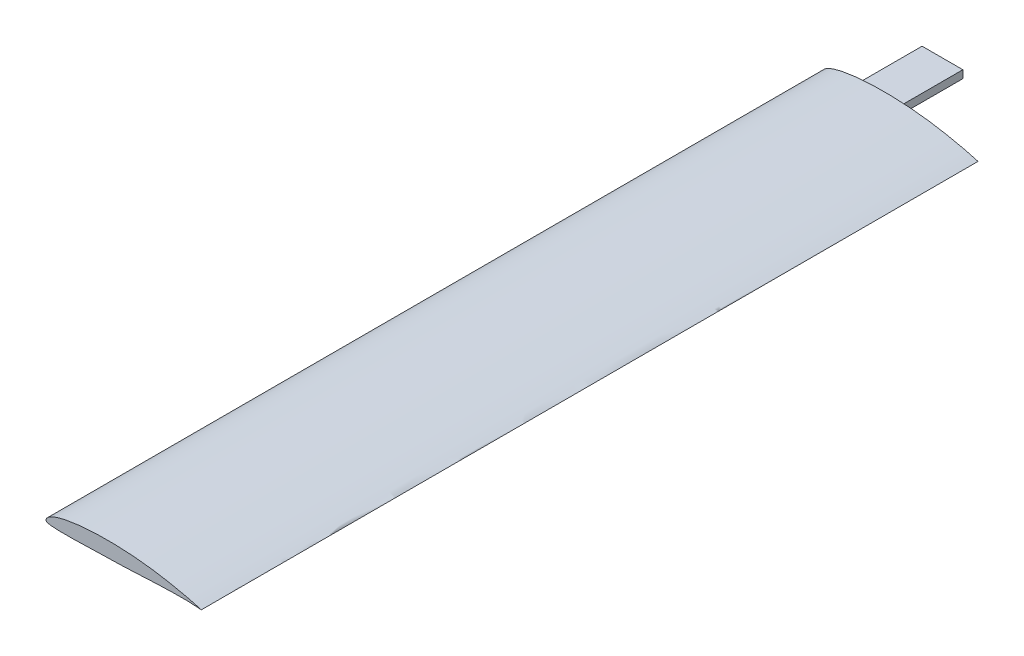
ISO-10303-21;
HEADER;
FILE_DESCRIPTION(('STEP AP214'),'2;1');
FILE_NAME('part.step','',(''),(''),'','','');
FILE_SCHEMA(('AUTOMOTIVE_DESIGN { 1 0 10303 214 1 1 1 1 }'));
ENDSEC;
DATA;
#1=APPLICATION_CONTEXT('core data for automotive mechanical design processes');
#2=APPLICATION_PROTOCOL_DEFINITION('international standard','automotive_design',2000,#1);
#3=PRODUCT_CONTEXT('',#1,'mechanical');
#4=PRODUCT('Part','Part','',(#3));
#5=PRODUCT_RELATED_PRODUCT_CATEGORY('part','',(#4));
#6=PRODUCT_DEFINITION_FORMATION('','',#4);
#7=PRODUCT_DEFINITION_CONTEXT('part definition',#1,'design');
#8=PRODUCT_DEFINITION('design','',#6,#7);
#9=PRODUCT_DEFINITION_SHAPE('','',#8);
#10=(LENGTH_UNIT() NAMED_UNIT(*) SI_UNIT(.MILLI.,.METRE.));
#11=(NAMED_UNIT(*) PLANE_ANGLE_UNIT() SI_UNIT($,.RADIAN.));
#12=(NAMED_UNIT(*) SI_UNIT($,.STERADIAN.) SOLID_ANGLE_UNIT());
#13=UNCERTAINTY_MEASURE_WITH_UNIT(LENGTH_MEASURE(1.E-05),#10,'distance_accuracy_value','');
#14=(GEOMETRIC_REPRESENTATION_CONTEXT(3) GLOBAL_UNCERTAINTY_ASSIGNED_CONTEXT((#13)) GLOBAL_UNIT_ASSIGNED_CONTEXT((#10,
#11,#12)) REPRESENTATION_CONTEXT('',''));
#15=CARTESIAN_POINT('',(0.,0.,0.));
#16=DIRECTION('',(0.,0.,1.));
#17=DIRECTION('',(1.,0.,0.));
#18=AXIS2_PLACEMENT_3D('',#15,#16,#17);
#19=CARTESIAN_POINT('',(0.0799089818777097,0.240125239944841,0.));
#20=DIRECTION('',(0.,0.,-1.));
#21=DIRECTION('',(-1.,0.,0.));
#22=AXIS2_PLACEMENT_3D('',#19,#20,#21);
#23=PLANE('',#22);
#24=CARTESIAN_POINT('',(20.,0.,0.));
#25=CARTESIAN_POINT('',(20.0000616999304,0.000713723228831209,0.));
#26=CARTESIAN_POINT('',(19.9186876472864,0.0188605158071753,0.));
#27=CARTESIAN_POINT('',(19.8390580157621,0.0447587552333484,0.));
#28=CARTESIAN_POINT('',(19.6507773157517,0.0992720768781434,0.));
#29=CARTESIAN_POINT('',(19.4266929157315,0.167829756253734,0.));
#30=CARTESIAN_POINT('',(19.1403192820766,0.251016200997859,0.));
#31=CARTESIAN_POINT('',(18.804647653194,0.340685843389795,0.));
#32=CARTESIAN_POINT('',(18.4163738640327,0.435228853157008,0.));
#33=CARTESIAN_POINT('',(17.9794279404684,0.536783049487092,0.));
#34=CARTESIAN_POINT('',(17.4964314219451,0.64426173784656,0.));
#35=CARTESIAN_POINT('',(16.9718858273627,0.756317907825864,0.));
#36=CARTESIAN_POINT('',(16.4102067270899,0.871962751057677,0.));
#37=CARTESIAN_POINT('',(15.8157022922553,0.988126599190793,0.));
#38=CARTESIAN_POINT('',(15.1933334908118,1.1036262356362,0.));
#39=CARTESIAN_POINT('',(14.5465142915021,1.2142522124294,0.));
#40=CARTESIAN_POINT('',(13.8776200914698,1.31540292012517,0.));
#41=CARTESIAN_POINT('',(13.1895770029886,1.40814922211923,0.));
#42=CARTESIAN_POINT('',(12.4852294010817,1.49072830412502,0.));
#43=CARTESIAN_POINT('',(11.7682834878895,1.56183417411719,0.));
#44=CARTESIAN_POINT('',(11.0423930283662,1.62209719355619,0.));
#45=CARTESIAN_POINT('',(10.3112767483753,1.67038038812707,0.));
#46=CARTESIAN_POINT('',(9.57879644723356,1.70581081222354,0.));
#47=CARTESIAN_POINT('',(8.84886718080066,1.72940315203071,0.));
#48=CARTESIAN_POINT('',(8.12530151505626,1.73920046458302,0.));
#49=CARTESIAN_POINT('',(7.41200224375604,1.73717790538759,0.));
#50=CARTESIAN_POINT('',(6.71281012774943,1.72218356508274,0.));
#51=CARTESIAN_POINT('',(6.03168636213999,1.6945010168291,0.));
#52=CARTESIAN_POINT('',(5.37231581674025,1.65530216775667,0.));
#53=CARTESIAN_POINT('',(4.73836750489327,1.60436191180966,0.));
#54=CARTESIAN_POINT('',(4.13337414976313,1.54158930117063,0.));
#55=CARTESIAN_POINT('',(3.56051880339029,1.46865978955658,0.));
#56=CARTESIAN_POINT('',(3.02304962607876,1.38495070752292,0.));
#57=CARTESIAN_POINT('',(2.523566236022,1.29256666253387,0.));
#58=CARTESIAN_POINT('',(2.06480058031591,1.19095903596349,0.));
#59=CARTESIAN_POINT('',(1.64907954715083,1.08141428527233,0.));
#60=CARTESIAN_POINT('',(1.27799302204674,0.965584304384791,0.));
#61=CARTESIAN_POINT('',(0.953509243569503,0.842297369572308,0.));
#62=CARTESIAN_POINT('',(0.67628706581373,0.714471376938814,0.));
#63=CARTESIAN_POINT('',(0.446514585816165,0.58311928623783,0.));
#64=CARTESIAN_POINT('',(0.2650544396117,0.447953694764488,0.));
#65=CARTESIAN_POINT('',(0.129663159106462,0.31503525214759,0.));
#66=CARTESIAN_POINT('',(0.0386508057888845,0.183213804411406,0.));
#67=CARTESIAN_POINT('',(0.00133674253390864,0.0598215817653653,0.));
#68=CARTESIAN_POINT('',(-0.0052827003903937,-0.0596022623067347,0.));
#69=CARTESIAN_POINT('',(0.0865748704919721,-0.151538207979241,0.));
#70=CARTESIAN_POINT('',(0.23239101017169,-0.202757564670096,0.));
#71=CARTESIAN_POINT('',(0.432924492056313,-0.257999047098922,0.));
#72=CARTESIAN_POINT('',(0.695579926793297,-0.295499247563094,0.));
#73=CARTESIAN_POINT('',(1.01821706697237,-0.322892671951828,0.));
#74=CARTESIAN_POINT('',(1.40170651741872,-0.339960306046254,0.));
#75=CARTESIAN_POINT('',(1.84366453008666,-0.350523765975219,0.));
#76=CARTESIAN_POINT('',(2.34126411368201,-0.354330121505421,0.));
#77=CARTESIAN_POINT('',(2.89062126125247,-0.353552603618188,0.));
#78=CARTESIAN_POINT('',(3.48783207684376,-0.347752511046903,0.));
#79=CARTESIAN_POINT('',(4.12870298640437,-0.338510920679211,0.));
#80=CARTESIAN_POINT('',(4.80870273449198,-0.325865061064325,0.));
#81=CARTESIAN_POINT('',(5.52303167232929,-0.310268316198622,0.));
#82=CARTESIAN_POINT('',(6.26669539048733,-0.292190963898323,0.));
#83=CARTESIAN_POINT('',(7.03455281521258,-0.27163259001217,0.));
#84=CARTESIAN_POINT('',(7.82135667849277,-0.249312497250456,0.));
#85=CARTESIAN_POINT('',(8.62163561602127,-0.224647035206241,0.));
#86=CARTESIAN_POINT('',(9.43025614594265,-0.19683297665696,0.));
#87=CARTESIAN_POINT('',(10.2427272566119,-0.164779131882778,0.));
#88=CARTESIAN_POINT('',(11.0553149305593,-0.128821575185591,0.));
#89=CARTESIAN_POINT('',(11.8643553560695,-0.0900365665196953,0.));
#90=CARTESIAN_POINT('',(12.6656365283791,-0.0498465968024134,0.));
#91=CARTESIAN_POINT('',(13.454261838245,-0.0109496830654113,0.));
#92=CARTESIAN_POINT('',(14.2247679381124,0.0245855026724503,0.));
#93=CARTESIAN_POINT('',(14.9711036294046,0.0547230001841831,0.));
#94=CARTESIAN_POINT('',(15.6869703878551,0.0789739698677158,0.));
#95=CARTESIAN_POINT('',(16.3662052771761,0.0955714464071993,0.));
#96=CARTESIAN_POINT('',(17.002628224721,0.104939148230276,0.));
#97=CARTESIAN_POINT('',(17.5905077797316,0.107101990938003,0.));
#98=CARTESIAN_POINT('',(18.1239796694914,0.101811208900467,0.));
#99=CARTESIAN_POINT('',(18.598436762017,0.0910888218714163,0.));
#100=CARTESIAN_POINT('',(19.0074073688876,0.0755377621970842,0.));
#101=CARTESIAN_POINT('',(19.3520203045928,0.0568589204654511,0.));
#102=CARTESIAN_POINT('',(19.6146251395515,0.0397624732996757,0.));
#103=CARTESIAN_POINT('',(19.8271795244655,0.0185981101029331,0.));
#104=CARTESIAN_POINT('',(19.914882704842,0.0123883452025731,0.));
#105=CARTESIAN_POINT('',(19.9999377341726,-0.000720269327091331,0.));
#106=CARTESIAN_POINT('',(20.,0.,0.));
#107=B_SPLINE_CURVE_WITH_KNOTS('',3,(#24,#25,#26,#27,#28,#29,#30,#31,#32,#33,#34,#35,#36,#37,
#38,#39,#40,#41,#42,#43,#44,#45,#46,#47,#48,#49,#50,#51,#52,#53,#54,#55,#56,#57,#58,#59,#60,#61,
#62,#63,#64,#65,#66,#67,#68,#69,#70,#71,#72,#73,#74,#75,#76,#77,#78,#79,#80,#81,#82,#83,#84,#85,
#86,#87,#88,#89,#90,#91,#92,#93,#94,#95,#96,#97,#98,#99,#100,#101,#102,#103,#104,#105,#106),
.UNSPECIFIED.,.T.,.F.,(4,1,1,1,1,1,1,1,1,1,1,1,1,1,1,1,1,1,1,1,1,1,1,1,1,1,1,1,1,1,1,1,1,1,1,1,
1,1,1,1,1,1,1,1,1,1,1,1,1,1,1,1,1,1,1,1,1,1,1,1,1,1,1,1,1,1,1,1,1,1,1,1,1,1,1,1,1,1,1,1,4),(0.,
0.000980753468582114,0.00381806564346867,0.00830705145963294,0.014259744993925,
0.0215439935262354,0.0300873610241464,0.0398949656933781,0.0509430826872985,0.0631186295911958,
0.0763203815321834,0.0904316818405658,0.105336052184633,0.120914795433531,0.137031896764836,
0.153643772156295,0.170715876337749,0.18814157169263,0.205850125481384,0.223753841053701,
0.241763153711,0.259789289213181,0.277739644041934,0.295525800261018,0.313060251250426,
0.33025040104813,0.347008909331878,0.363243003847813,0.37887591143692,0.393826638392149,
0.408017844828091,0.421385186363768,0.433866928429371,0.445407465113336,0.455969555884104,
0.465508428076868,0.474013428507728,0.481506411003234,0.487961274055355,0.493465500793043,
0.4981085651222,0.501907593400314,0.505060685912869,0.507629982862686,0.510152512056076,
0.513900058980971,0.518981961474634,0.525445327459363,0.533392089701122,0.542820301190656,
0.553698437203164,0.56593804965582,0.579453187332898,0.594141872574564,0.60990635974517,
0.626638895234382,0.644211949767691,0.662507706659186,0.681403506151385,0.700761806939102,
0.720455450551647,0.740347909985681,0.760327433169952,0.780315809166263,0.80022894505359,
0.819957275209238,0.839380253457661,0.858358071237851,0.876741993380868,0.894369906519205,
0.911089883042455,0.926761139147779,0.941228400429278,0.954366215094575,0.966044044210389,
0.976141018307896,0.984569133533522,0.991239945830632,0.996068596658994,0.999010251295849,1.),.UNSPECIFIED.);
#108=CARTESIAN_POINT('',(20.,0.,0.));
#109=VERTEX_POINT('',#108);
#110=EDGE_CURVE('E52',#109,#109,#107,.T.);
#111=ORIENTED_EDGE('',*,*,#110,.F.);
#112=EDGE_LOOP('',(#111));
#113=FACE_BOUND('',#112,.T.);
#114=DIRECTION('',(-1.,0.,0.));
#115=VECTOR('',#114,1.);
#116=CARTESIAN_POINT('',(10.05,0.25,0.));
#117=LINE('',#116,#115);
#118=CARTESIAN_POINT('',(10.05,0.25,0.));
#119=VERTEX_POINT('',#118);
#120=CARTESIAN_POINT('',(4.8,0.25,0.));
#121=VERTEX_POINT('',#120);
#122=EDGE_CURVE('E107',#119,#121,#117,.T.);
#123=ORIENTED_EDGE('',*,*,#122,.F.);
#124=DIRECTION('',(0.,-1.,0.));
#125=VECTOR('',#124,1.);
#126=CARTESIAN_POINT('',(10.05,0.25,0.));
#127=LINE('',#126,#125);
#128=CARTESIAN_POINT('',(10.05,1.25,0.));
#129=VERTEX_POINT('',#128);
#130=EDGE_CURVE('E121',#129,#119,#127,.T.);
#131=ORIENTED_EDGE('',*,*,#130,.F.);
#132=DIRECTION('',(1.,0.,0.));
#133=VECTOR('',#132,1.);
#134=CARTESIAN_POINT('',(10.05,1.25,0.));
#135=LINE('',#134,#133);
#136=CARTESIAN_POINT('',(4.8,1.25,0.));
#137=VERTEX_POINT('',#136);
#138=EDGE_CURVE('E87',#137,#129,#135,.T.);
#139=ORIENTED_EDGE('',*,*,#138,.F.);
#140=DIRECTION('',(0.,1.,0.));
#141=VECTOR('',#140,1.);
#142=CARTESIAN_POINT('',(4.8,0.25,0.));
#143=LINE('',#142,#141);
#144=EDGE_CURVE('E127',#121,#137,#143,.T.);
#145=ORIENTED_EDGE('',*,*,#144,.F.);
#146=EDGE_LOOP('',(#123,#131,#139,#145));
#147=FACE_BOUND('',#146,.T.);
#148=ADVANCED_FACE('F47',(#113,#147),#23,.T.);
#149=CARTESIAN_POINT('',(20.,0.,100.));
#150=CARTESIAN_POINT('',(20.0000616999304,0.000713723228831209,100.));
#151=CARTESIAN_POINT('',(19.9186876472864,0.0188605158071753,100.));
#152=CARTESIAN_POINT('',(19.8390580157621,0.0447587552333484,100.));
#153=CARTESIAN_POINT('',(19.6507773157517,0.0992720768781434,100.));
#154=CARTESIAN_POINT('',(19.4266929157315,0.167829756253734,100.));
#155=CARTESIAN_POINT('',(19.1403192820766,0.251016200997859,100.));
#156=CARTESIAN_POINT('',(18.804647653194,0.340685843389795,100.));
#157=CARTESIAN_POINT('',(18.4163738640327,0.435228853157008,100.));
#158=CARTESIAN_POINT('',(17.9794279404684,0.536783049487092,100.));
#159=CARTESIAN_POINT('',(17.4964314219451,0.64426173784656,100.));
#160=CARTESIAN_POINT('',(16.9718858273627,0.756317907825864,100.));
#161=CARTESIAN_POINT('',(16.4102067270899,0.871962751057677,100.));
#162=CARTESIAN_POINT('',(15.8157022922553,0.988126599190793,100.));
#163=CARTESIAN_POINT('',(15.1933334908118,1.1036262356362,100.));
#164=CARTESIAN_POINT('',(14.5465142915021,1.2142522124294,100.));
#165=CARTESIAN_POINT('',(13.8776200914698,1.31540292012517,100.));
#166=CARTESIAN_POINT('',(13.1895770029886,1.40814922211923,100.));
#167=CARTESIAN_POINT('',(12.4852294010817,1.49072830412502,100.));
#168=CARTESIAN_POINT('',(11.7682834878895,1.56183417411719,100.));
#169=CARTESIAN_POINT('',(11.0423930283662,1.62209719355619,100.));
#170=CARTESIAN_POINT('',(10.3112767483753,1.67038038812707,100.));
#171=CARTESIAN_POINT('',(9.57879644723356,1.70581081222354,100.));
#172=CARTESIAN_POINT('',(8.84886718080066,1.72940315203071,100.));
#173=CARTESIAN_POINT('',(8.12530151505626,1.73920046458302,100.));
#174=CARTESIAN_POINT('',(7.41200224375604,1.73717790538759,100.));
#175=CARTESIAN_POINT('',(6.71281012774943,1.72218356508274,100.));
#176=CARTESIAN_POINT('',(6.03168636213999,1.6945010168291,100.));
#177=CARTESIAN_POINT('',(5.37231581674025,1.65530216775667,100.));
#178=CARTESIAN_POINT('',(4.73836750489327,1.60436191180966,100.));
#179=CARTESIAN_POINT('',(4.13337414976313,1.54158930117063,100.));
#180=CARTESIAN_POINT('',(3.56051880339029,1.46865978955658,100.));
#181=CARTESIAN_POINT('',(3.02304962607876,1.38495070752292,100.));
#182=CARTESIAN_POINT('',(2.523566236022,1.29256666253387,100.));
#183=CARTESIAN_POINT('',(2.06480058031591,1.19095903596349,100.));
#184=CARTESIAN_POINT('',(1.64907954715083,1.08141428527233,100.));
#185=CARTESIAN_POINT('',(1.27799302204674,0.965584304384791,100.));
#186=CARTESIAN_POINT('',(0.953509243569503,0.842297369572308,100.));
#187=CARTESIAN_POINT('',(0.67628706581373,0.714471376938814,100.));
#188=CARTESIAN_POINT('',(0.446514585816165,0.58311928623783,100.));
#189=CARTESIAN_POINT('',(0.2650544396117,0.447953694764488,100.));
#190=CARTESIAN_POINT('',(0.129663159106462,0.31503525214759,100.));
#191=CARTESIAN_POINT('',(0.0386508057888845,0.183213804411406,100.));
#192=CARTESIAN_POINT('',(0.00133674253390864,0.0598215817653653,100.));
#193=CARTESIAN_POINT('',(-0.0052827003903937,-0.0596022623067347,100.));
#194=CARTESIAN_POINT('',(0.0865748704919721,-0.151538207979241,100.));
#195=CARTESIAN_POINT('',(0.23239101017169,-0.202757564670096,100.));
#196=CARTESIAN_POINT('',(0.432924492056313,-0.257999047098922,100.));
#197=CARTESIAN_POINT('',(0.695579926793297,-0.295499247563094,100.));
#198=CARTESIAN_POINT('',(1.01821706697237,-0.322892671951828,100.));
#199=CARTESIAN_POINT('',(1.40170651741872,-0.339960306046254,100.));
#200=CARTESIAN_POINT('',(1.84366453008666,-0.350523765975219,100.));
#201=CARTESIAN_POINT('',(2.34126411368201,-0.354330121505421,100.));
#202=CARTESIAN_POINT('',(2.89062126125247,-0.353552603618188,100.));
#203=CARTESIAN_POINT('',(3.48783207684376,-0.347752511046903,100.));
#204=CARTESIAN_POINT('',(4.12870298640437,-0.338510920679211,100.));
#205=CARTESIAN_POINT('',(4.80870273449198,-0.325865061064325,100.));
#206=CARTESIAN_POINT('',(5.52303167232929,-0.310268316198622,100.));
#207=CARTESIAN_POINT('',(6.26669539048733,-0.292190963898323,100.));
#208=CARTESIAN_POINT('',(7.03455281521258,-0.27163259001217,100.));
#209=CARTESIAN_POINT('',(7.82135667849277,-0.249312497250456,100.));
#210=CARTESIAN_POINT('',(8.62163561602127,-0.224647035206241,100.));
#211=CARTESIAN_POINT('',(9.43025614594265,-0.19683297665696,100.));
#212=CARTESIAN_POINT('',(10.2427272566119,-0.164779131882778,100.));
#213=CARTESIAN_POINT('',(11.0553149305593,-0.128821575185591,100.));
#214=CARTESIAN_POINT('',(11.8643553560695,-0.0900365665196953,100.));
#215=CARTESIAN_POINT('',(12.6656365283791,-0.0498465968024134,100.));
#216=CARTESIAN_POINT('',(13.454261838245,-0.0109496830654113,100.));
#217=CARTESIAN_POINT('',(14.2247679381124,0.0245855026724503,100.));
#218=CARTESIAN_POINT('',(14.9711036294046,0.0547230001841831,100.));
#219=CARTESIAN_POINT('',(15.6869703878551,0.0789739698677158,100.));
#220=CARTESIAN_POINT('',(16.3662052771761,0.0955714464071993,100.));
#221=CARTESIAN_POINT('',(17.002628224721,0.104939148230276,100.));
#222=CARTESIAN_POINT('',(17.5905077797316,0.107101990938003,100.));
#223=CARTESIAN_POINT('',(18.1239796694914,0.101811208900467,100.));
#224=CARTESIAN_POINT('',(18.598436762017,0.0910888218714163,100.));
#225=CARTESIAN_POINT('',(19.0074073688876,0.0755377621970842,100.));
#226=CARTESIAN_POINT('',(19.3520203045928,0.0568589204654511,100.));
#227=CARTESIAN_POINT('',(19.6146251395515,0.0397624732996757,100.));
#228=CARTESIAN_POINT('',(19.8271795244655,0.0185981101029331,100.));
#229=CARTESIAN_POINT('',(19.914882704842,0.0123883452025731,100.));
#230=CARTESIAN_POINT('',(19.9999377341726,-0.000720269327091331,100.));
#231=CARTESIAN_POINT('',(20.,0.,100.));
#232=B_SPLINE_CURVE_WITH_KNOTS('',3,(#149,#150,#151,#152,#153,#154,#155,#156,#157,#158,#159,
#160,#161,#162,#163,#164,#165,#166,#167,#168,#169,#170,#171,#172,#173,#174,#175,#176,#177,#178,
#179,#180,#181,#182,#183,#184,#185,#186,#187,#188,#189,#190,#191,#192,#193,#194,#195,#196,#197,
#198,#199,#200,#201,#202,#203,#204,#205,#206,#207,#208,#209,#210,#211,#212,#213,#214,#215,#216,
#217,#218,#219,#220,#221,#222,#223,#224,#225,#226,#227,#228,#229,#230,#231),.UNSPECIFIED.,.T.,
.F.,(4,1,1,1,1,1,1,1,1,1,1,1,1,1,1,1,1,1,1,1,1,1,1,1,1,1,1,1,1,1,1,1,1,1,1,1,1,1,1,1,1,1,1,1,1,
1,1,1,1,1,1,1,1,1,1,1,1,1,1,1,1,1,1,1,1,1,1,1,1,1,1,1,1,1,1,1,1,1,1,1,4),(0.,
0.000980753468582114,0.00381806564346867,0.00830705145963294,0.014259744993925,
0.0215439935262354,0.0300873610241464,0.0398949656933781,0.0509430826872985,0.0631186295911958,
0.0763203815321834,0.0904316818405658,0.105336052184633,0.120914795433531,0.137031896764836,
0.153643772156295,0.170715876337749,0.18814157169263,0.205850125481384,0.223753841053701,
0.241763153711,0.259789289213181,0.277739644041934,0.295525800261018,0.313060251250426,
0.33025040104813,0.347008909331878,0.363243003847813,0.37887591143692,0.393826638392149,
0.408017844828091,0.421385186363768,0.433866928429371,0.445407465113336,0.455969555884104,
0.465508428076868,0.474013428507728,0.481506411003234,0.487961274055355,0.493465500793043,
0.4981085651222,0.501907593400314,0.505060685912869,0.507629982862686,0.510152512056076,
0.513900058980971,0.518981961474634,0.525445327459363,0.533392089701122,0.542820301190656,
0.553698437203164,0.56593804965582,0.579453187332898,0.594141872574564,0.60990635974517,
0.626638895234382,0.644211949767691,0.662507706659186,0.681403506151385,0.700761806939102,
0.720455450551647,0.740347909985681,0.760327433169952,0.780315809166263,0.80022894505359,
0.819957275209238,0.839380253457661,0.858358071237851,0.876741993380868,0.894369906519205,
0.911089883042455,0.926761139147779,0.941228400429278,0.954366215094575,0.966044044210389,
0.976141018307896,0.984569133533522,0.991239945830632,0.996068596658994,0.999010251295849,1.),.UNSPECIFIED.);
#233=DIRECTION('',(0.,0.,-1.));
#234=VECTOR('',#233,1.);
#235=SURFACE_OF_LINEAR_EXTRUSION('',#232,#234);
#236=CARTESIAN_POINT('',(20.,0.,100.));
#237=VERTEX_POINT('',#236);
#238=EDGE_CURVE('E11',#237,#237,#232,.T.);
#239=ORIENTED_EDGE('',*,*,#238,.F.);
#240=EDGE_LOOP('',(#239));
#241=FACE_BOUND('',#240,.T.);
#242=ORIENTED_EDGE('',*,*,#110,.T.);
#243=EDGE_LOOP('',(#242));
#244=FACE_BOUND('',#243,.T.);
#245=ADVANCED_FACE('F49',(#241,#244),#235,.F.);
#246=CARTESIAN_POINT('',(0.0799089818777097,0.240125239944841,100.));
#247=DIRECTION('',(0.,0.,-1.));
#248=DIRECTION('',(-1.,0.,0.));
#249=AXIS2_PLACEMENT_3D('',#246,#247,#248);
#250=PLANE('',#249);
#251=ORIENTED_EDGE('',*,*,#238,.T.);
#252=EDGE_LOOP('',(#251));
#253=FACE_BOUND('',#252,.T.);
#254=ADVANCED_FACE('F167',(#253),#250,.F.);
#255=CARTESIAN_POINT('',(10.05,0.25,-8.));
#256=DIRECTION('',(-1.,0.,0.));
#257=DIRECTION('',(0.,0.,1.));
#258=AXIS2_PLACEMENT_3D('',#255,#256,#257);
#259=PLANE('',#258);
#260=ORIENTED_EDGE('',*,*,#130,.T.);
#261=DIRECTION('',(0.,0.,1.));
#262=VECTOR('',#261,1.);
#263=CARTESIAN_POINT('',(10.05,0.25,-8.));
#264=LINE('',#263,#262);
#265=CARTESIAN_POINT('',(10.05,0.25,-8.));
#266=VERTEX_POINT('',#265);
#267=EDGE_CURVE('E111',#266,#119,#264,.T.);
#268=ORIENTED_EDGE('',*,*,#267,.F.);
#269=DIRECTION('',(0.,-1.,0.));
#270=VECTOR('',#269,1.);
#271=CARTESIAN_POINT('',(10.05,0.25,-8.));
#272=LINE('',#271,#270);
#273=CARTESIAN_POINT('',(10.05,1.25,-8.));
#274=VERTEX_POINT('',#273);
#275=EDGE_CURVE('E99',#274,#266,#272,.T.);
#276=ORIENTED_EDGE('',*,*,#275,.F.);
#277=DIRECTION('',(0.,0.,1.));
#278=VECTOR('',#277,1.);
#279=CARTESIAN_POINT('',(10.05,1.25,-8.));
#280=LINE('',#279,#278);
#281=EDGE_CURVE('E117',#274,#129,#280,.T.);
#282=ORIENTED_EDGE('',*,*,#281,.T.);
#283=EDGE_LOOP('',(#260,#268,#276,#282));
#284=FACE_BOUND('',#283,.T.);
#285=ADVANCED_FACE('F152',(#284),#259,.F.);
#286=CARTESIAN_POINT('',(10.05,0.25,-8.));
#287=DIRECTION('',(0.,1.,0.));
#288=DIRECTION('',(0.,0.,1.));
#289=AXIS2_PLACEMENT_3D('',#286,#287,#288);
#290=PLANE('',#289);
#291=ORIENTED_EDGE('',*,*,#122,.T.);
#292=DIRECTION('',(0.,0.,1.));
#293=VECTOR('',#292,1.);
#294=CARTESIAN_POINT('',(4.8,0.25,-8.));
#295=LINE('',#294,#293);
#296=CARTESIAN_POINT('',(4.8,0.25,-8.));
#297=VERTEX_POINT('',#296);
#298=EDGE_CURVE('E104',#297,#121,#295,.T.);
#299=ORIENTED_EDGE('',*,*,#298,.F.);
#300=DIRECTION('',(-1.,0.,0.));
#301=VECTOR('',#300,1.);
#302=CARTESIAN_POINT('',(10.05,0.25,-8.));
#303=LINE('',#302,#301);
#304=EDGE_CURVE('E94',#266,#297,#303,.T.);
#305=ORIENTED_EDGE('',*,*,#304,.F.);
#306=ORIENTED_EDGE('',*,*,#267,.T.);
#307=EDGE_LOOP('',(#291,#299,#305,#306));
#308=FACE_BOUND('',#307,.T.);
#309=ADVANCED_FACE('F105',(#308),#290,.F.);
#310=CARTESIAN_POINT('',(4.8,0.25,-8.));
#311=DIRECTION('',(1.,0.,0.));
#312=DIRECTION('',(0.,1.,0.));
#313=AXIS2_PLACEMENT_3D('',#310,#311,#312);
#314=PLANE('',#313);
#315=ORIENTED_EDGE('',*,*,#144,.T.);
#316=DIRECTION('',(0.,0.,1.));
#317=VECTOR('',#316,1.);
#318=CARTESIAN_POINT('',(4.8,1.25,-8.));
#319=LINE('',#318,#317);
#320=CARTESIAN_POINT('',(4.8,1.25,-8.));
#321=VERTEX_POINT('',#320);
#322=EDGE_CURVE('E65',#321,#137,#319,.T.);
#323=ORIENTED_EDGE('',*,*,#322,.F.);
#324=DIRECTION('',(0.,1.,0.));
#325=VECTOR('',#324,1.);
#326=CARTESIAN_POINT('',(4.8,0.25,-8.));
#327=LINE('',#326,#325);
#328=EDGE_CURVE('E97',#297,#321,#327,.T.);
#329=ORIENTED_EDGE('',*,*,#328,.F.);
#330=ORIENTED_EDGE('',*,*,#298,.T.);
#331=EDGE_LOOP('',(#315,#323,#329,#330));
#332=FACE_BOUND('',#331,.T.);
#333=ADVANCED_FACE('F113',(#332),#314,.F.);
#334=CARTESIAN_POINT('',(10.05,1.25,-8.));
#335=DIRECTION('',(0.,-1.,0.));
#336=DIRECTION('',(0.,0.,-1.));
#337=AXIS2_PLACEMENT_3D('',#334,#335,#336);
#338=PLANE('',#337);
#339=ORIENTED_EDGE('',*,*,#138,.T.);
#340=ORIENTED_EDGE('',*,*,#281,.F.);
#341=DIRECTION('',(1.,0.,0.));
#342=VECTOR('',#341,1.);
#343=CARTESIAN_POINT('',(10.05,1.25,-8.));
#344=LINE('',#343,#342);
#345=EDGE_CURVE('E73',#321,#274,#344,.T.);
#346=ORIENTED_EDGE('',*,*,#345,.F.);
#347=ORIENTED_EDGE('',*,*,#322,.T.);
#348=EDGE_LOOP('',(#339,#340,#346,#347));
#349=FACE_BOUND('',#348,.T.);
#350=ADVANCED_FACE('F153',(#349),#338,.F.);
#351=CARTESIAN_POINT('',(0.,0.,-8.));
#352=DIRECTION('',(0.,0.,1.));
#353=DIRECTION('',(1.,0.,0.));
#354=AXIS2_PLACEMENT_3D('',#351,#352,#353);
#355=PLANE('',#354);
#356=ORIENTED_EDGE('',*,*,#275,.T.);
#357=ORIENTED_EDGE('',*,*,#304,.T.);
#358=ORIENTED_EDGE('',*,*,#328,.T.);
#359=ORIENTED_EDGE('',*,*,#345,.T.);
#360=EDGE_LOOP('',(#356,#357,#358,#359));
#361=FACE_BOUND('',#360,.T.);
#362=ADVANCED_FACE('F95',(#361),#355,.F.);
#363=CLOSED_SHELL('',(#148,#245,#254,#285,#309,#333,#350,#362));
#364=MANIFOLD_SOLID_BREP('B2',#363);
#365=ADVANCED_BREP_SHAPE_REPRESENTATION('',(#18,#364),#14);
#366=SHAPE_DEFINITION_REPRESENTATION(#9,#365);
ENDSEC;
END-ISO-10303-21;
